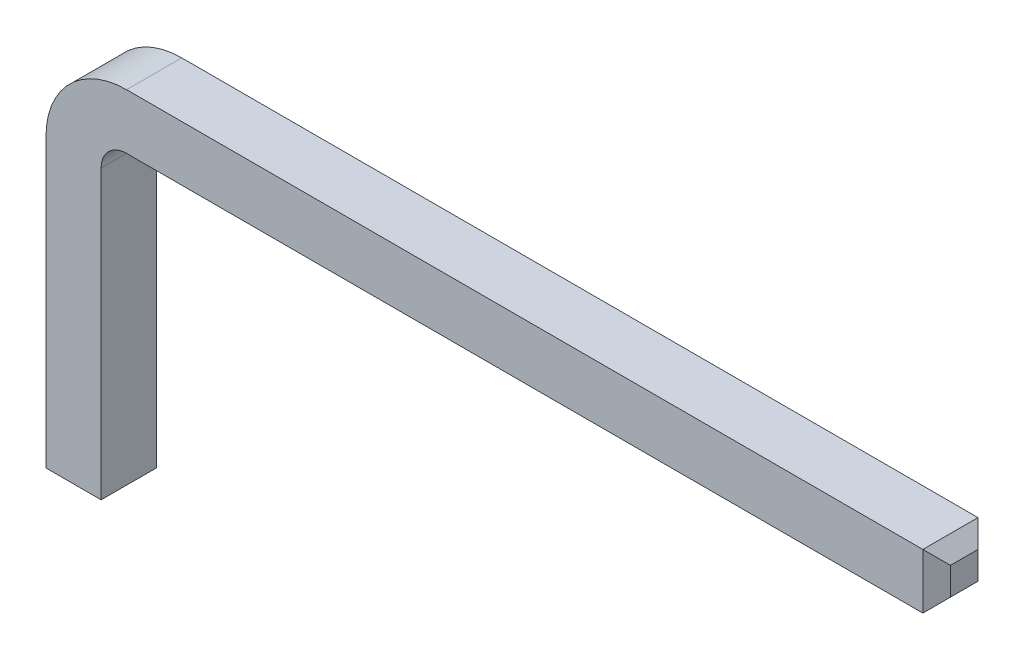
ISO-10303-21;
HEADER;
FILE_DESCRIPTION(('STEP AP214'),'2;1');
FILE_NAME('part.step','',(''),(''),'','','');
FILE_SCHEMA(('AUTOMOTIVE_DESIGN { 1 0 10303 214 1 1 1 1 }'));
ENDSEC;
DATA;
#1=APPLICATION_CONTEXT('core data for automotive mechanical design processes');
#2=APPLICATION_PROTOCOL_DEFINITION('international standard','automotive_design',2000,#1);
#3=PRODUCT_CONTEXT('',#1,'mechanical');
#4=PRODUCT('Part','Part','',(#3));
#5=PRODUCT_RELATED_PRODUCT_CATEGORY('part','',(#4));
#6=PRODUCT_DEFINITION_FORMATION('','',#4);
#7=PRODUCT_DEFINITION_CONTEXT('part definition',#1,'design');
#8=PRODUCT_DEFINITION('design','',#6,#7);
#9=PRODUCT_DEFINITION_SHAPE('','',#8);
#10=(LENGTH_UNIT() NAMED_UNIT(*) SI_UNIT(.MILLI.,.METRE.));
#11=(NAMED_UNIT(*) PLANE_ANGLE_UNIT() SI_UNIT($,.RADIAN.));
#12=(NAMED_UNIT(*) SI_UNIT($,.STERADIAN.) SOLID_ANGLE_UNIT());
#13=UNCERTAINTY_MEASURE_WITH_UNIT(LENGTH_MEASURE(1.E-05),#10,'distance_accuracy_value','');
#14=(GEOMETRIC_REPRESENTATION_CONTEXT(3) GLOBAL_UNCERTAINTY_ASSIGNED_CONTEXT((#13)) GLOBAL_UNIT_ASSIGNED_CONTEXT((#10,
#11,#12)) REPRESENTATION_CONTEXT('',''));
#15=CARTESIAN_POINT('',(0.,0.,0.));
#16=DIRECTION('',(0.,0.,1.));
#17=DIRECTION('',(1.,0.,0.));
#18=AXIS2_PLACEMENT_3D('',#15,#16,#17);
#19=CARTESIAN_POINT('',(0.,0.,0.65));
#20=DIRECTION('',(0.,1.,0.));
#21=DIRECTION('',(0.,0.,1.));
#22=AXIS2_PLACEMENT_3D('',#19,#20,#21);
#23=PLANE('',#22);
#24=DIRECTION('',(0.,0.,1.));
#25=VECTOR('',#24,1.);
#26=CARTESIAN_POINT('',(0.487499999999999,0.,0.65));
#27=LINE('',#26,#25);
#28=CARTESIAN_POINT('',(0.487499999999999,0.,0.162500000000001));
#29=VERTEX_POINT('',#28);
#30=CARTESIAN_POINT('',(0.487499999999999,0.,0.487499999999999));
#31=VERTEX_POINT('',#30);
#32=EDGE_CURVE('E180',#29,#31,#27,.T.);
#33=ORIENTED_EDGE('',*,*,#32,.T.);
#34=DIRECTION('',(-1.,0.,0.));
#35=VECTOR('',#34,1.);
#36=CARTESIAN_POINT('',(0.,0.,0.487499999999999));
#37=LINE('',#36,#35);
#38=CARTESIAN_POINT('',(0.162500000000001,0.,0.487499999999999));
#39=VERTEX_POINT('',#38);
#40=EDGE_CURVE('E186',#31,#39,#37,.T.);
#41=ORIENTED_EDGE('',*,*,#40,.T.);
#42=DIRECTION('',(0.,0.,-1.));
#43=VECTOR('',#42,1.);
#44=CARTESIAN_POINT('',(0.162500000000001,0.,0.65));
#45=LINE('',#44,#43);
#46=CARTESIAN_POINT('',(0.162500000000001,0.,0.162500000000001));
#47=VERTEX_POINT('',#46);
#48=EDGE_CURVE('E184',#39,#47,#45,.T.);
#49=ORIENTED_EDGE('',*,*,#48,.T.);
#50=DIRECTION('',(1.,0.,0.));
#51=VECTOR('',#50,1.);
#52=CARTESIAN_POINT('',(0.65,0.,0.162500000000001));
#53=LINE('',#52,#51);
#54=EDGE_CURVE('E182',#47,#29,#53,.T.);
#55=ORIENTED_EDGE('',*,*,#54,.T.);
#56=EDGE_LOOP('',(#33,#41,#49,#55));
#57=FACE_BOUND('',#56,.T.);
#58=ADVANCED_FACE('F31',(#57),#23,.F.);
#59=CARTESIAN_POINT('',(0.65,3.55000000000001,0.65));
#60=DIRECTION('',(-1.,0.,0.));
#61=DIRECTION('',(0.,-1.,0.));
#62=AXIS2_PLACEMENT_3D('',#59,#60,#61);
#63=PLANE('',#62);
#64=DIRECTION('',(0.,1.,0.));
#65=VECTOR('',#64,1.);
#66=CARTESIAN_POINT('',(0.65,3.55000000000001,0.65));
#67=LINE('',#66,#65);
#68=CARTESIAN_POINT('',(0.65,0.1625,0.65));
#69=VERTEX_POINT('',#68);
#70=CARTESIAN_POINT('',(0.65,3.55000000000001,0.65));
#71=VERTEX_POINT('',#70);
#72=EDGE_CURVE('E156',#69,#71,#67,.T.);
#73=ORIENTED_EDGE('',*,*,#72,.F.);
#74=DIRECTION('',(0.,0.,-1.));
#75=VECTOR('',#74,1.);
#76=CARTESIAN_POINT('',(0.65,0.1625,0.65));
#77=LINE('',#76,#75);
#78=CARTESIAN_POINT('',(0.65,0.1625,0.));
#79=VERTEX_POINT('',#78);
#80=EDGE_CURVE('E125',#69,#79,#77,.T.);
#81=ORIENTED_EDGE('',*,*,#80,.T.);
#82=DIRECTION('',(0.,1.,0.));
#83=VECTOR('',#82,1.);
#84=CARTESIAN_POINT('',(0.65,3.55000000000001,0.));
#85=LINE('',#84,#83);
#86=CARTESIAN_POINT('',(0.65,3.55000000000001,0.));
#87=VERTEX_POINT('',#86);
#88=EDGE_CURVE('E118',#79,#87,#85,.T.);
#89=ORIENTED_EDGE('',*,*,#88,.T.);
#90=DIRECTION('',(0.,0.,-1.));
#91=VECTOR('',#90,1.);
#92=CARTESIAN_POINT('',(0.65,3.55000000000001,0.65));
#93=LINE('',#92,#91);
#94=EDGE_CURVE('E122',#71,#87,#93,.T.);
#95=ORIENTED_EDGE('',*,*,#94,.F.);
#96=EDGE_LOOP('',(#73,#81,#89,#95));
#97=FACE_BOUND('',#96,.T.);
#98=ADVANCED_FACE('F121',(#97),#63,.F.);
#99=CARTESIAN_POINT('',(0.95,3.55000000000001,0.65));
#100=DIRECTION('',(0.,0.,-1.));
#101=DIRECTION('',(-1.,0.,0.));
#102=AXIS2_PLACEMENT_3D('',#99,#100,#101);
#103=CYLINDRICAL_SURFACE('',#102,0.3);
#104=CARTESIAN_POINT('',(0.95,3.55000000000001,0.));
#105=DIRECTION('',(0.,0.,-1.));
#106=DIRECTION('',(-1.,0.,0.));
#107=AXIS2_PLACEMENT_3D('',#104,#105,#106);
#108=CIRCLE('',#107,0.3);
#109=CARTESIAN_POINT('',(0.95,3.85000000000001,0.));
#110=VERTEX_POINT('',#109);
#111=EDGE_CURVE('E129',#87,#110,#108,.T.);
#112=ORIENTED_EDGE('',*,*,#111,.T.);
#113=DIRECTION('',(0.,0.,-1.));
#114=VECTOR('',#113,1.);
#115=CARTESIAN_POINT('',(0.95,3.85000000000001,0.65));
#116=LINE('',#115,#114);
#117=CARTESIAN_POINT('',(0.95,3.85000000000001,0.65));
#118=VERTEX_POINT('',#117);
#119=EDGE_CURVE('E138',#118,#110,#116,.T.);
#120=ORIENTED_EDGE('',*,*,#119,.F.);
#121=CARTESIAN_POINT('',(0.95,3.55000000000001,0.65));
#122=DIRECTION('',(0.,0.,-1.));
#123=DIRECTION('',(-1.,0.,0.));
#124=AXIS2_PLACEMENT_3D('',#121,#122,#123);
#125=CIRCLE('',#124,0.3);
#126=EDGE_CURVE('E136',#71,#118,#125,.T.);
#127=ORIENTED_EDGE('',*,*,#126,.F.);
#128=ORIENTED_EDGE('',*,*,#94,.T.);
#129=EDGE_LOOP('',(#112,#120,#127,#128));
#130=FACE_BOUND('',#129,.T.);
#131=ADVANCED_FACE('F133',(#130),#103,.F.);
#132=CARTESIAN_POINT('',(0.95,3.85000000000001,0.65));
#133=DIRECTION('',(0.,1.,0.));
#134=DIRECTION('',(-1.,0.,0.));
#135=AXIS2_PLACEMENT_3D('',#132,#133,#134);
#136=PLANE('',#135);
#137=DIRECTION('',(1.,0.,0.));
#138=VECTOR('',#137,1.);
#139=CARTESIAN_POINT('',(0.95,3.85000000000001,0.));
#140=LINE('',#139,#138);
#141=CARTESIAN_POINT('',(10.3375,3.85,0.));
#142=VERTEX_POINT('',#141);
#143=EDGE_CURVE('E144',#110,#142,#140,.T.);
#144=ORIENTED_EDGE('',*,*,#143,.T.);
#145=DIRECTION('',(0.,0.,1.));
#146=VECTOR('',#145,1.);
#147=CARTESIAN_POINT('',(10.3375,3.85,0.65));
#148=LINE('',#147,#146);
#149=CARTESIAN_POINT('',(10.3375,3.85,0.65));
#150=VERTEX_POINT('',#149);
#151=EDGE_CURVE('E38',#142,#150,#148,.T.);
#152=ORIENTED_EDGE('',*,*,#151,.T.);
#153=DIRECTION('',(1.,0.,0.));
#154=VECTOR('',#153,1.);
#155=CARTESIAN_POINT('',(0.95,3.85000000000001,0.65));
#156=LINE('',#155,#154);
#157=EDGE_CURVE('E159',#118,#150,#156,.T.);
#158=ORIENTED_EDGE('',*,*,#157,.F.);
#159=ORIENTED_EDGE('',*,*,#119,.T.);
#160=EDGE_LOOP('',(#144,#152,#158,#159));
#161=FACE_BOUND('',#160,.T.);
#162=ADVANCED_FACE('F204',(#161),#136,.F.);
#163=CARTESIAN_POINT('',(10.5,4.5,0.65));
#164=DIRECTION('',(-1.,0.,0.));
#165=DIRECTION('',(0.,0.,1.));
#166=AXIS2_PLACEMENT_3D('',#163,#164,#165);
#167=PLANE('',#166);
#168=DIRECTION('',(0.,0.,-1.));
#169=VECTOR('',#168,1.);
#170=CARTESIAN_POINT('',(10.5,4.0125,0.65));
#171=LINE('',#170,#169);
#172=CARTESIAN_POINT('',(10.5,4.0125,0.4875));
#173=VERTEX_POINT('',#172);
#174=CARTESIAN_POINT('',(10.5,4.0125,0.1625));
#175=VERTEX_POINT('',#174);
#176=EDGE_CURVE('E45',#173,#175,#171,.T.);
#177=ORIENTED_EDGE('',*,*,#176,.T.);
#178=DIRECTION('',(0.,1.,0.));
#179=VECTOR('',#178,1.);
#180=CARTESIAN_POINT('',(10.5,4.5,0.1625));
#181=LINE('',#180,#179);
#182=CARTESIAN_POINT('',(10.5,4.3375,0.1625));
#183=VERTEX_POINT('',#182);
#184=EDGE_CURVE('E200',#175,#183,#181,.T.);
#185=ORIENTED_EDGE('',*,*,#184,.T.);
#186=DIRECTION('',(0.,0.,1.));
#187=VECTOR('',#186,1.);
#188=CARTESIAN_POINT('',(10.5,4.3375,0.65));
#189=LINE('',#188,#187);
#190=CARTESIAN_POINT('',(10.5,4.3375,0.4875));
#191=VERTEX_POINT('',#190);
#192=EDGE_CURVE('E196',#183,#191,#189,.T.);
#193=ORIENTED_EDGE('',*,*,#192,.T.);
#194=DIRECTION('',(0.,-1.,0.));
#195=VECTOR('',#194,1.);
#196=CARTESIAN_POINT('',(10.5,4.5,0.4875));
#197=LINE('',#196,#195);
#198=EDGE_CURVE('E50',#191,#173,#197,.T.);
#199=ORIENTED_EDGE('',*,*,#198,.T.);
#200=EDGE_LOOP('',(#177,#185,#193,#199));
#201=FACE_BOUND('',#200,.T.);
#202=ADVANCED_FACE('F273',(#201),#167,.F.);
#203=CARTESIAN_POINT('',(0.95,4.5,0.65));
#204=DIRECTION('',(0.,-1.,0.));
#205=DIRECTION('',(0.,0.,-1.));
#206=AXIS2_PLACEMENT_3D('',#203,#204,#205);
#207=PLANE('',#206);
#208=DIRECTION('',(-1.,0.,0.));
#209=VECTOR('',#208,1.);
#210=CARTESIAN_POINT('',(0.95,4.5,0.65));
#211=LINE('',#210,#209);
#212=CARTESIAN_POINT('',(10.3375,4.5,0.65));
#213=VERTEX_POINT('',#212);
#214=CARTESIAN_POINT('',(0.95,4.50000000000001,0.65));
#215=VERTEX_POINT('',#214);
#216=EDGE_CURVE('E162',#213,#215,#211,.T.);
#217=ORIENTED_EDGE('',*,*,#216,.F.);
#218=DIRECTION('',(0.,0.,-1.));
#219=VECTOR('',#218,1.);
#220=CARTESIAN_POINT('',(10.3375,4.5,0.65));
#221=LINE('',#220,#219);
#222=CARTESIAN_POINT('',(10.3375,4.5,0.));
#223=VERTEX_POINT('',#222);
#224=EDGE_CURVE('E11',#213,#223,#221,.T.);
#225=ORIENTED_EDGE('',*,*,#224,.T.);
#226=DIRECTION('',(-1.,0.,0.));
#227=VECTOR('',#226,1.);
#228=CARTESIAN_POINT('',(0.95,4.5,0.));
#229=LINE('',#228,#227);
#230=CARTESIAN_POINT('',(0.95,4.50000000000001,0.));
#231=VERTEX_POINT('',#230);
#232=EDGE_CURVE('E146',#223,#231,#229,.T.);
#233=ORIENTED_EDGE('',*,*,#232,.T.);
#234=DIRECTION('',(0.,0.,-1.));
#235=VECTOR('',#234,1.);
#236=CARTESIAN_POINT('',(0.95,4.50000000000001,0.65));
#237=LINE('',#236,#235);
#238=EDGE_CURVE('E172',#215,#231,#237,.T.);
#239=ORIENTED_EDGE('',*,*,#238,.F.);
#240=EDGE_LOOP('',(#217,#225,#233,#239));
#241=FACE_BOUND('',#240,.T.);
#242=ADVANCED_FACE('F263',(#241),#207,.F.);
#243=CARTESIAN_POINT('',(0.95,3.55000000000001,0.65));
#244=DIRECTION('',(0.,0.,-1.));
#245=DIRECTION('',(-1.,0.,0.));
#246=AXIS2_PLACEMENT_3D('',#243,#244,#245);
#247=CYLINDRICAL_SURFACE('',#246,0.949999999999995);
#248=CARTESIAN_POINT('',(0.95,3.55000000000001,0.));
#249=DIRECTION('',(0.,0.,1.));
#250=DIRECTION('',(-1.,0.,0.));
#251=AXIS2_PLACEMENT_3D('',#248,#249,#250);
#252=CIRCLE('',#251,0.949999999999995);
#253=CARTESIAN_POINT('',(0.,3.55000000000003,0.));
#254=VERTEX_POINT('',#253);
#255=EDGE_CURVE('E151',#231,#254,#252,.T.);
#256=ORIENTED_EDGE('',*,*,#255,.T.);
#257=DIRECTION('',(0.,0.,-1.));
#258=VECTOR('',#257,1.);
#259=CARTESIAN_POINT('',(0.,3.55000000000003,0.65));
#260=LINE('',#259,#258);
#261=CARTESIAN_POINT('',(0.,3.55000000000003,0.65));
#262=VERTEX_POINT('',#261);
#263=EDGE_CURVE('E169',#262,#254,#260,.T.);
#264=ORIENTED_EDGE('',*,*,#263,.F.);
#265=CARTESIAN_POINT('',(0.95,3.55000000000001,0.65));
#266=DIRECTION('',(0.,0.,1.));
#267=DIRECTION('',(-1.,0.,0.));
#268=AXIS2_PLACEMENT_3D('',#265,#266,#267);
#269=CIRCLE('',#268,0.949999999999995);
#270=EDGE_CURVE('E164',#215,#262,#269,.T.);
#271=ORIENTED_EDGE('',*,*,#270,.F.);
#272=ORIENTED_EDGE('',*,*,#238,.T.);
#273=EDGE_LOOP('',(#256,#264,#271,#272));
#274=FACE_BOUND('',#273,.T.);
#275=ADVANCED_FACE('F260',(#274),#247,.T.);
#276=CARTESIAN_POINT('',(0.,3.55000000000003,0.65));
#277=DIRECTION('',(1.,0.,0.));
#278=DIRECTION('',(0.,0.,-1.));
#279=AXIS2_PLACEMENT_3D('',#276,#277,#278);
#280=PLANE('',#279);
#281=DIRECTION('',(0.,-1.,0.));
#282=VECTOR('',#281,1.);
#283=CARTESIAN_POINT('',(0.,3.55000000000003,0.));
#284=LINE('',#283,#282);
#285=CARTESIAN_POINT('',(0.,0.1625,0.));
#286=VERTEX_POINT('',#285);
#287=EDGE_CURVE('E153',#254,#286,#284,.T.);
#288=ORIENTED_EDGE('',*,*,#287,.T.);
#289=DIRECTION('',(0.,0.,1.));
#290=VECTOR('',#289,1.);
#291=CARTESIAN_POINT('',(0.,0.1625,0.65));
#292=LINE('',#291,#290);
#293=CARTESIAN_POINT('',(0.,0.1625,0.65));
#294=VERTEX_POINT('',#293);
#295=EDGE_CURVE('E189',#286,#294,#292,.T.);
#296=ORIENTED_EDGE('',*,*,#295,.T.);
#297=DIRECTION('',(0.,-1.,0.));
#298=VECTOR('',#297,1.);
#299=CARTESIAN_POINT('',(0.,3.55000000000003,0.65));
#300=LINE('',#299,#298);
#301=EDGE_CURVE('E166',#262,#294,#300,.T.);
#302=ORIENTED_EDGE('',*,*,#301,.F.);
#303=ORIENTED_EDGE('',*,*,#263,.T.);
#304=EDGE_LOOP('',(#288,#296,#302,#303));
#305=FACE_BOUND('',#304,.T.);
#306=ADVANCED_FACE('F254',(#305),#280,.F.);
#307=CARTESIAN_POINT('',(0.95,3.55000000000001,0.65));
#308=DIRECTION('',(0.,0.,-1.));
#309=DIRECTION('',(-1.,0.,0.));
#310=AXIS2_PLACEMENT_3D('',#307,#308,#309);
#311=PLANE('',#310);
#312=ORIENTED_EDGE('',*,*,#301,.T.);
#313=DIRECTION('',(1.,0.,0.));
#314=VECTOR('',#313,1.);
#315=CARTESIAN_POINT('',(0.95,0.1625,0.65));
#316=LINE('',#315,#314);
#317=EDGE_CURVE('E177',#294,#69,#316,.T.);
#318=ORIENTED_EDGE('',*,*,#317,.T.);
#319=ORIENTED_EDGE('',*,*,#72,.T.);
#320=ORIENTED_EDGE('',*,*,#126,.T.);
#321=ORIENTED_EDGE('',*,*,#157,.T.);
#322=DIRECTION('',(0.,1.,0.));
#323=VECTOR('',#322,1.);
#324=CARTESIAN_POINT('',(10.3375,3.55000000000001,0.65));
#325=LINE('',#324,#323);
#326=EDGE_CURVE('E137',#150,#213,#325,.T.);
#327=ORIENTED_EDGE('',*,*,#326,.T.);
#328=ORIENTED_EDGE('',*,*,#216,.T.);
#329=ORIENTED_EDGE('',*,*,#270,.T.);
#330=EDGE_LOOP('',(#312,#318,#319,#320,#321,#327,#328,#329));
#331=FACE_BOUND('',#330,.T.);
#332=ADVANCED_FACE('F209',(#331),#311,.F.);
#333=CARTESIAN_POINT('',(0.95,3.55000000000001,0.));
#334=DIRECTION('',(0.,0.,-1.));
#335=DIRECTION('',(-1.,0.,0.));
#336=AXIS2_PLACEMENT_3D('',#333,#334,#335);
#337=PLANE('',#336);
#338=ORIENTED_EDGE('',*,*,#88,.F.);
#339=DIRECTION('',(-1.,0.,0.));
#340=VECTOR('',#339,1.);
#341=CARTESIAN_POINT('',(0.,0.1625,0.));
#342=LINE('',#341,#340);
#343=EDGE_CURVE('E193',#79,#286,#342,.T.);
#344=ORIENTED_EDGE('',*,*,#343,.T.);
#345=ORIENTED_EDGE('',*,*,#287,.F.);
#346=ORIENTED_EDGE('',*,*,#255,.F.);
#347=ORIENTED_EDGE('',*,*,#232,.F.);
#348=DIRECTION('',(0.,-1.,0.));
#349=VECTOR('',#348,1.);
#350=CARTESIAN_POINT('',(10.3375,3.85,0.));
#351=LINE('',#350,#349);
#352=EDGE_CURVE('E191',#223,#142,#351,.T.);
#353=ORIENTED_EDGE('',*,*,#352,.T.);
#354=ORIENTED_EDGE('',*,*,#143,.F.);
#355=ORIENTED_EDGE('',*,*,#111,.F.);
#356=EDGE_LOOP('',(#338,#344,#345,#346,#347,#353,#354,#355));
#357=FACE_BOUND('',#356,.T.);
#358=ADVANCED_FACE('F141',(#357),#337,.T.);
#359=CARTESIAN_POINT('',(0.,0.,0.162500000000001));
#360=DIRECTION('',(0.,-0.707106781186549,-0.707106781186546));
#361=DIRECTION('',(0.,0.707106781186546,-0.707106781186549));
#362=AXIS2_PLACEMENT_3D('',#359,#360,#361);
#363=PLANE('',#362);
#364=DIRECTION('',(-0.577350269189627,-0.577350269189624,0.577350269189627));
#365=VECTOR('',#364,1.);
#366=CARTESIAN_POINT('',(0.433333333333333,-0.0541666666666665,0.216666666666667));
#367=LINE('',#366,#365);
#368=EDGE_CURVE('E228',#29,#79,#367,.F.);
#369=ORIENTED_EDGE('',*,*,#368,.F.);
#370=ORIENTED_EDGE('',*,*,#54,.F.);
#371=DIRECTION('',(0.577350269189627,-0.577350269189624,0.577350269189627));
#372=VECTOR('',#371,1.);
#373=CARTESIAN_POINT('',(0.108333333333334,0.0541666666666668,0.108333333333334));
#374=LINE('',#373,#372);
#375=EDGE_CURVE('E130',#286,#47,#374,.T.);
#376=ORIENTED_EDGE('',*,*,#375,.F.);
#377=ORIENTED_EDGE('',*,*,#343,.F.);
#378=EDGE_LOOP('',(#369,#370,#376,#377));
#379=FACE_BOUND('',#378,.T.);
#380=ADVANCED_FACE('F240',(#379),#363,.T.);
#381=CARTESIAN_POINT('',(0.162500000000001,0.,0.65));
#382=DIRECTION('',(0.707106781186546,0.707106781186549,0.));
#383=DIRECTION('',(-0.707106781186549,0.707106781186546,0.));
#384=AXIS2_PLACEMENT_3D('',#381,#382,#383);
#385=PLANE('',#384);
#386=ORIENTED_EDGE('',*,*,#375,.T.);
#387=ORIENTED_EDGE('',*,*,#48,.F.);
#388=DIRECTION('',(-0.577350269189627,0.577350269189624,0.577350269189627));
#389=VECTOR('',#388,1.);
#390=CARTESIAN_POINT('',(0.108333333333334,0.0541666666666668,0.541666666666666));
#391=LINE('',#390,#389);
#392=EDGE_CURVE('E221',#294,#39,#391,.F.);
#393=ORIENTED_EDGE('',*,*,#392,.F.);
#394=ORIENTED_EDGE('',*,*,#295,.F.);
#395=EDGE_LOOP('',(#386,#387,#393,#394));
#396=FACE_BOUND('',#395,.T.);
#397=ADVANCED_FACE('F235',(#396),#385,.F.);
#398=CARTESIAN_POINT('',(0.65,0.1625,0.65));
#399=DIRECTION('',(-0.707106781186546,0.707106781186549,0.));
#400=DIRECTION('',(-0.707106781186549,-0.707106781186546,0.));
#401=AXIS2_PLACEMENT_3D('',#398,#399,#400);
#402=PLANE('',#401);
#403=ORIENTED_EDGE('',*,*,#368,.T.);
#404=ORIENTED_EDGE('',*,*,#80,.F.);
#405=DIRECTION('',(-0.577350269189627,-0.577350269189624,-0.577350269189627));
#406=VECTOR('',#405,1.);
#407=CARTESIAN_POINT('',(0.65,0.1625,0.65));
#408=LINE('',#407,#406);
#409=EDGE_CURVE('E219',#31,#69,#408,.F.);
#410=ORIENTED_EDGE('',*,*,#409,.F.);
#411=ORIENTED_EDGE('',*,*,#32,.F.);
#412=EDGE_LOOP('',(#403,#404,#410,#411));
#413=FACE_BOUND('',#412,.T.);
#414=ADVANCED_FACE('F249',(#413),#402,.F.);
#415=CARTESIAN_POINT('',(0.95,0.1625,0.65));
#416=DIRECTION('',(0.,0.707106781186549,-0.707106781186546));
#417=DIRECTION('',(0.,0.707106781186546,0.707106781186549));
#418=AXIS2_PLACEMENT_3D('',#415,#416,#417);
#419=PLANE('',#418);
#420=ORIENTED_EDGE('',*,*,#392,.T.);
#421=ORIENTED_EDGE('',*,*,#40,.F.);
#422=ORIENTED_EDGE('',*,*,#409,.T.);
#423=ORIENTED_EDGE('',*,*,#317,.F.);
#424=EDGE_LOOP('',(#420,#421,#422,#423));
#425=FACE_BOUND('',#424,.T.);
#426=ADVANCED_FACE('F246',(#425),#419,.F.);
#427=CARTESIAN_POINT('',(10.3375,3.55000000000001,0.65));
#428=DIRECTION('',(-0.707106781186546,0.,-0.707106781186549));
#429=DIRECTION('',(-0.707106781186549,0.,0.707106781186546));
#430=AXIS2_PLACEMENT_3D('',#427,#428,#429);
#431=PLANE('',#430);
#432=DIRECTION('',(0.577350269189628,-0.577350269189625,-0.577350269189625));
#433=VECTOR('',#432,1.);
#434=CARTESIAN_POINT('',(10.3375,4.5,0.65));
#435=LINE('',#434,#433);
#436=EDGE_CURVE('E216',#213,#191,#435,.T.);
#437=ORIENTED_EDGE('',*,*,#436,.F.);
#438=ORIENTED_EDGE('',*,*,#326,.F.);
#439=DIRECTION('',(0.577350269189627,0.577350269189626,-0.577350269189624));
#440=VECTOR('',#439,1.);
#441=CARTESIAN_POINT('',(10.2375,3.75,0.749999999999996));
#442=LINE('',#441,#440);
#443=EDGE_CURVE('E214',#173,#150,#442,.F.);
#444=ORIENTED_EDGE('',*,*,#443,.F.);
#445=ORIENTED_EDGE('',*,*,#198,.F.);
#446=EDGE_LOOP('',(#437,#438,#444,#445));
#447=FACE_BOUND('',#446,.T.);
#448=ADVANCED_FACE('F213',(#447),#431,.F.);
#449=CARTESIAN_POINT('',(10.5,4.0125,0.65));
#450=DIRECTION('',(-0.707106781186547,0.707106781186548,0.));
#451=DIRECTION('',(-0.707106781186548,-0.707106781186547,0.));
#452=AXIS2_PLACEMENT_3D('',#449,#450,#451);
#453=PLANE('',#452);
#454=ORIENTED_EDGE('',*,*,#443,.T.);
#455=ORIENTED_EDGE('',*,*,#151,.F.);
#456=DIRECTION('',(-0.577350269189627,-0.577350269189626,-0.577350269189624));
#457=VECTOR('',#456,1.);
#458=CARTESIAN_POINT('',(10.6625,4.175,0.324999999999999));
#459=LINE('',#458,#457);
#460=EDGE_CURVE('E223',#175,#142,#459,.T.);
#461=ORIENTED_EDGE('',*,*,#460,.F.);
#462=ORIENTED_EDGE('',*,*,#176,.F.);
#463=EDGE_LOOP('',(#454,#455,#461,#462));
#464=FACE_BOUND('',#463,.T.);
#465=ADVANCED_FACE('F218',(#464),#453,.F.);
#466=CARTESIAN_POINT('',(10.3375,4.5,0.65));
#467=DIRECTION('',(-0.707106781186546,-0.707106781186549,0.));
#468=DIRECTION('',(0.707106781186549,-0.707106781186546,0.));
#469=AXIS2_PLACEMENT_3D('',#466,#467,#468);
#470=PLANE('',#469);
#471=ORIENTED_EDGE('',*,*,#436,.T.);
#472=ORIENTED_EDGE('',*,*,#192,.F.);
#473=DIRECTION('',(0.577350269189628,-0.577350269189625,0.577350269189625));
#474=VECTOR('',#473,1.);
#475=CARTESIAN_POINT('',(10.5541666666667,4.28333333333333,0.216666666666666));
#476=LINE('',#475,#474);
#477=EDGE_CURVE('E268',#223,#183,#476,.T.);
#478=ORIENTED_EDGE('',*,*,#477,.F.);
#479=ORIENTED_EDGE('',*,*,#224,.F.);
#480=EDGE_LOOP('',(#471,#472,#478,#479));
#481=FACE_BOUND('',#480,.T.);
#482=ADVANCED_FACE('F266',(#481),#470,.F.);
#483=CARTESIAN_POINT('',(10.5,4.5,0.1625));
#484=DIRECTION('',(0.707106781186546,0.,-0.707106781186549));
#485=DIRECTION('',(-0.707106781186549,0.,-0.707106781186546));
#486=AXIS2_PLACEMENT_3D('',#483,#484,#485);
#487=PLANE('',#486);
#488=ORIENTED_EDGE('',*,*,#460,.T.);
#489=ORIENTED_EDGE('',*,*,#352,.F.);
#490=ORIENTED_EDGE('',*,*,#477,.T.);
#491=ORIENTED_EDGE('',*,*,#184,.F.);
#492=EDGE_LOOP('',(#488,#489,#490,#491));
#493=FACE_BOUND('',#492,.T.);
#494=ADVANCED_FACE('F272',(#493),#487,.T.);
#495=CLOSED_SHELL('',(#58,#98,#131,#162,#202,#242,#275,#306,#332,#358,#380,#397,#414,#426,#448,
#465,#482,#494));
#496=MANIFOLD_SOLID_BREP('B2',#495);
#497=ADVANCED_BREP_SHAPE_REPRESENTATION('',(#18,#496),#14);
#498=SHAPE_DEFINITION_REPRESENTATION(#9,#497);
ENDSEC;
END-ISO-10303-21;
